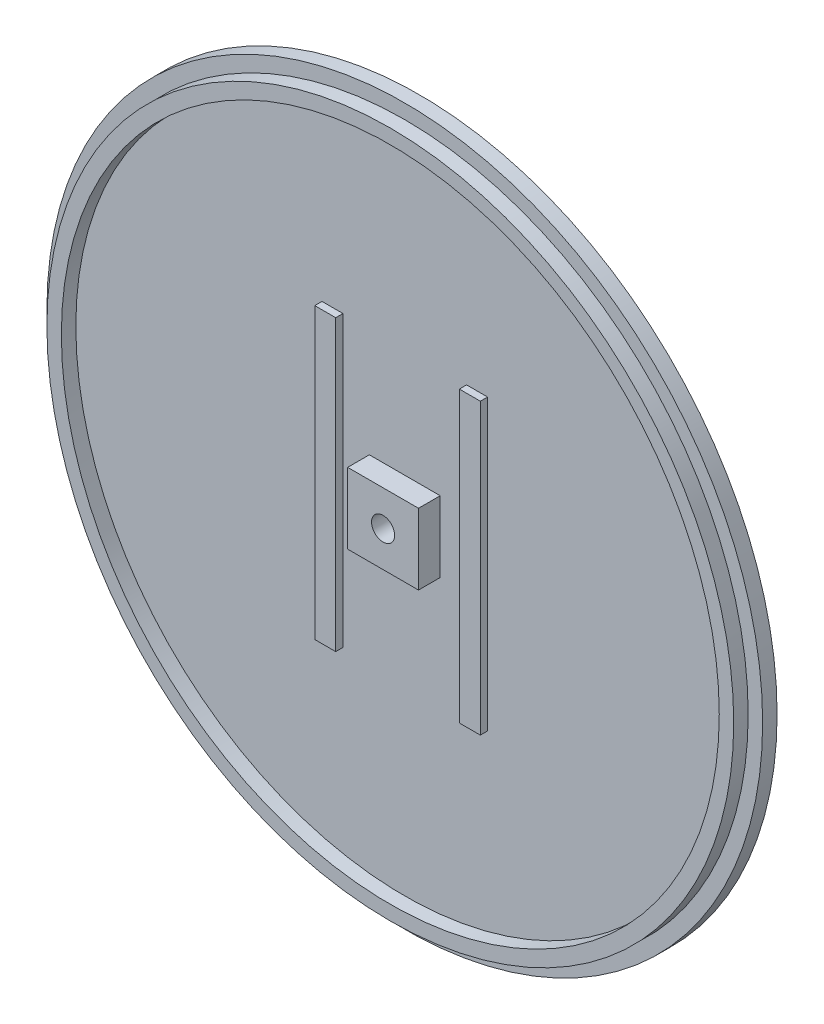
ISO-10303-21;
HEADER;
FILE_DESCRIPTION(('STEP AP214'),'2;1');
FILE_NAME('part.step','',(''),(''),'','','');
FILE_SCHEMA(('AUTOMOTIVE_DESIGN { 1 0 10303 214 1 1 1 1 }'));
ENDSEC;
DATA;
#1=APPLICATION_CONTEXT('core data for automotive mechanical design processes');
#2=APPLICATION_PROTOCOL_DEFINITION('international standard','automotive_design',2000,#1);
#3=PRODUCT_CONTEXT('',#1,'mechanical');
#4=PRODUCT('Part','Part','',(#3));
#5=PRODUCT_RELATED_PRODUCT_CATEGORY('part','',(#4));
#6=PRODUCT_DEFINITION_FORMATION('','',#4);
#7=PRODUCT_DEFINITION_CONTEXT('part definition',#1,'design');
#8=PRODUCT_DEFINITION('design','',#6,#7);
#9=PRODUCT_DEFINITION_SHAPE('','',#8);
#10=(LENGTH_UNIT() NAMED_UNIT(*) SI_UNIT(.MILLI.,.METRE.));
#11=(NAMED_UNIT(*) PLANE_ANGLE_UNIT() SI_UNIT($,.RADIAN.));
#12=(NAMED_UNIT(*) SI_UNIT($,.STERADIAN.) SOLID_ANGLE_UNIT());
#13=UNCERTAINTY_MEASURE_WITH_UNIT(LENGTH_MEASURE(1.E-05),#10,'distance_accuracy_value','');
#14=(GEOMETRIC_REPRESENTATION_CONTEXT(3) GLOBAL_UNCERTAINTY_ASSIGNED_CONTEXT((#13)) GLOBAL_UNIT_ASSIGNED_CONTEXT((#10,
#11,#12)) REPRESENTATION_CONTEXT('',''));
#15=CARTESIAN_POINT('',(0.,0.,0.));
#16=DIRECTION('',(0.,0.,1.));
#17=DIRECTION('',(1.,0.,0.));
#18=AXIS2_PLACEMENT_3D('',#15,#16,#17);
#19=CARTESIAN_POINT('',(0.,0.,2.));
#20=DIRECTION('',(0.,0.,1.));
#21=DIRECTION('',(1.,0.,0.));
#22=AXIS2_PLACEMENT_3D('',#19,#20,#21);
#23=PLANE('',#22);
#24=DIRECTION('',(1.,0.,0.));
#25=VECTOR('',#24,1.);
#26=CARTESIAN_POINT('',(-4.9,-4.9,2.));
#27=LINE('',#26,#25);
#28=CARTESIAN_POINT('',(-4.9,-4.9,2.));
#29=VERTEX_POINT('',#28);
#30=CARTESIAN_POINT('',(4.9,-4.9,2.));
#31=VERTEX_POINT('',#30);
#32=EDGE_CURVE('E334',#29,#31,#27,.T.);
#33=ORIENTED_EDGE('',*,*,#32,.F.);
#34=DIRECTION('',(0.,-1.,0.));
#35=VECTOR('',#34,1.);
#36=CARTESIAN_POINT('',(-4.9,4.9,2.));
#37=LINE('',#36,#35);
#38=CARTESIAN_POINT('',(-4.9,4.9,2.));
#39=VERTEX_POINT('',#38);
#40=EDGE_CURVE('E146',#39,#29,#37,.T.);
#41=ORIENTED_EDGE('',*,*,#40,.F.);
#42=DIRECTION('',(-1.,0.,0.));
#43=VECTOR('',#42,1.);
#44=CARTESIAN_POINT('',(-4.9,4.9,2.));
#45=LINE('',#44,#43);
#46=CARTESIAN_POINT('',(4.9,4.9,2.));
#47=VERTEX_POINT('',#46);
#48=EDGE_CURVE('E142',#47,#39,#45,.T.);
#49=ORIENTED_EDGE('',*,*,#48,.F.);
#50=DIRECTION('',(0.,1.,0.));
#51=VECTOR('',#50,1.);
#52=CARTESIAN_POINT('',(4.9,4.9,2.));
#53=LINE('',#52,#51);
#54=EDGE_CURVE('E336',#31,#47,#53,.T.);
#55=ORIENTED_EDGE('',*,*,#54,.F.);
#56=EDGE_LOOP('',(#33,#41,#49,#55));
#57=FACE_BOUND('',#56,.T.);
#58=DIRECTION('',(1.,0.,0.));
#59=VECTOR('',#58,1.);
#60=CARTESIAN_POINT('',(8.54909975535215,-20.,2.));
#61=LINE('',#60,#59);
#62=CARTESIAN_POINT('',(8.54909975535215,-20.,2.));
#63=VERTEX_POINT('',#62);
#64=CARTESIAN_POINT('',(11.4509002446479,-20.,2.));
#65=VERTEX_POINT('',#64);
#66=EDGE_CURVE('E151',#63,#65,#61,.T.);
#67=ORIENTED_EDGE('',*,*,#66,.F.);
#68=DIRECTION('',(0.,-1.,0.));
#69=VECTOR('',#68,1.);
#70=CARTESIAN_POINT('',(8.54909975535215,20.,2.));
#71=LINE('',#70,#69);
#72=CARTESIAN_POINT('',(8.54909975535215,20.,2.));
#73=VERTEX_POINT('',#72);
#74=EDGE_CURVE('E148',#73,#63,#71,.T.);
#75=ORIENTED_EDGE('',*,*,#74,.F.);
#76=DIRECTION('',(-1.,0.,0.));
#77=VECTOR('',#76,1.);
#78=CARTESIAN_POINT('',(8.54909975535215,20.,2.));
#79=LINE('',#78,#77);
#80=CARTESIAN_POINT('',(11.4509002446478,20.,2.));
#81=VERTEX_POINT('',#80);
#82=EDGE_CURVE('E160',#81,#73,#79,.T.);
#83=ORIENTED_EDGE('',*,*,#82,.F.);
#84=DIRECTION('',(0.,1.,0.));
#85=VECTOR('',#84,1.);
#86=CARTESIAN_POINT('',(11.4509002446478,20.,2.));
#87=LINE('',#86,#85);
#88=EDGE_CURVE('E168',#65,#81,#87,.T.);
#89=ORIENTED_EDGE('',*,*,#88,.F.);
#90=EDGE_LOOP('',(#67,#75,#83,#89));
#91=FACE_BOUND('',#90,.T.);
#92=DIRECTION('',(1.,0.,0.));
#93=VECTOR('',#92,1.);
#94=CARTESIAN_POINT('',(-11.45,-20.,2.));
#95=LINE('',#94,#93);
#96=CARTESIAN_POINT('',(-11.45,-20.,2.));
#97=VERTEX_POINT('',#96);
#98=CARTESIAN_POINT('',(-8.55,-20.,2.));
#99=VERTEX_POINT('',#98);
#100=EDGE_CURVE('E193',#97,#99,#95,.T.);
#101=ORIENTED_EDGE('',*,*,#100,.F.);
#102=DIRECTION('',(0.,-1.,0.));
#103=VECTOR('',#102,1.);
#104=CARTESIAN_POINT('',(-11.45,20.,2.));
#105=LINE('',#104,#103);
#106=CARTESIAN_POINT('',(-11.45,20.,2.));
#107=VERTEX_POINT('',#106);
#108=EDGE_CURVE('E179',#107,#97,#105,.T.);
#109=ORIENTED_EDGE('',*,*,#108,.F.);
#110=DIRECTION('',(-1.,0.,0.));
#111=VECTOR('',#110,1.);
#112=CARTESIAN_POINT('',(-11.45,20.,2.));
#113=LINE('',#112,#111);
#114=CARTESIAN_POINT('',(-8.55,20.,2.));
#115=VERTEX_POINT('',#114);
#116=EDGE_CURVE('E184',#115,#107,#113,.T.);
#117=ORIENTED_EDGE('',*,*,#116,.F.);
#118=DIRECTION('',(0.,1.,0.));
#119=VECTOR('',#118,1.);
#120=CARTESIAN_POINT('',(-8.55,20.,2.));
#121=LINE('',#120,#119);
#122=EDGE_CURVE('E195',#99,#115,#121,.T.);
#123=ORIENTED_EDGE('',*,*,#122,.F.);
#124=EDGE_LOOP('',(#101,#109,#117,#123));
#125=FACE_BOUND('',#124,.T.);
#126=CARTESIAN_POINT('',(0.,0.,2.));
#127=DIRECTION('',(0.,0.,1.));
#128=DIRECTION('',(1.,0.,0.));
#129=AXIS2_PLACEMENT_3D('',#126,#127,#128);
#130=CIRCLE('',#129,45.5);
#131=CARTESIAN_POINT('',(45.5,0.,2.));
#132=VERTEX_POINT('',#131);
#133=EDGE_CURVE('E11',#132,#132,#130,.F.);
#134=ORIENTED_EDGE('',*,*,#133,.F.);
#135=EDGE_LOOP('',(#134));
#136=FACE_BOUND('',#135,.T.);
#137=ADVANCED_FACE('F33',(#57,#91,#125,#136),#23,.T.);
#138=CARTESIAN_POINT('',(0.,0.,2.));
#139=DIRECTION('',(0.,0.,1.));
#140=DIRECTION('',(1.,0.,0.));
#141=AXIS2_PLACEMENT_3D('',#138,#139,#140);
#142=CIRCLE('',#141,47.5);
#143=CARTESIAN_POINT('',(47.5,0.,2.));
#144=VERTEX_POINT('',#143);
#145=EDGE_CURVE('E313',#144,#144,#142,.T.);
#146=ORIENTED_EDGE('',*,*,#145,.F.);
#147=EDGE_LOOP('',(#146));
#148=FACE_BOUND('',#147,.T.);
#149=CARTESIAN_POINT('',(0.,0.,2.));
#150=DIRECTION('',(0.,0.,1.));
#151=DIRECTION('',(1.,0.,0.));
#152=AXIS2_PLACEMENT_3D('',#149,#150,#151);
#153=CIRCLE('',#152,49.5);
#154=CARTESIAN_POINT('',(49.5,0.,2.));
#155=VERTEX_POINT('',#154);
#156=EDGE_CURVE('E41',#155,#155,#153,.T.);
#157=ORIENTED_EDGE('',*,*,#156,.T.);
#158=EDGE_LOOP('',(#157));
#159=FACE_BOUND('',#158,.T.);
#160=ADVANCED_FACE('F225',(#148,#159),#23,.T.);
#161=CARTESIAN_POINT('',(0.,0.,2.));
#162=DIRECTION('',(0.,0.,-1.));
#163=DIRECTION('',(-1.,0.,0.));
#164=AXIS2_PLACEMENT_3D('',#161,#162,#163);
#165=CYLINDRICAL_SURFACE('',#164,49.5);
#166=ORIENTED_EDGE('',*,*,#156,.F.);
#167=EDGE_LOOP('',(#166));
#168=FACE_BOUND('',#167,.T.);
#169=CARTESIAN_POINT('',(0.,0.,0.));
#170=DIRECTION('',(0.,0.,1.));
#171=DIRECTION('',(1.,0.,0.));
#172=AXIS2_PLACEMENT_3D('',#169,#170,#171);
#173=CIRCLE('',#172,49.5);
#174=CARTESIAN_POINT('',(49.5,0.,0.));
#175=VERTEX_POINT('',#174);
#176=EDGE_CURVE('E208',#175,#175,#173,.T.);
#177=ORIENTED_EDGE('',*,*,#176,.T.);
#178=EDGE_LOOP('',(#177));
#179=FACE_BOUND('',#178,.T.);
#180=ADVANCED_FACE('F35',(#168,#179),#165,.T.);
#181=CARTESIAN_POINT('',(0.,0.,0.));
#182=DIRECTION('',(0.,0.,1.));
#183=DIRECTION('',(1.,0.,0.));
#184=AXIS2_PLACEMENT_3D('',#181,#182,#183);
#185=PLANE('',#184);
#186=CARTESIAN_POINT('',(0.,0.,0.));
#187=DIRECTION('',(0.,0.,-1.));
#188=DIRECTION('',(-1.,0.,0.));
#189=AXIS2_PLACEMENT_3D('',#186,#187,#188);
#190=CIRCLE('',#189,3.);
#191=CARTESIAN_POINT('',(-3.,0.,0.));
#192=VERTEX_POINT('',#191);
#193=EDGE_CURVE('E320',#192,#192,#190,.T.);
#194=ORIENTED_EDGE('',*,*,#193,.F.);
#195=EDGE_LOOP('',(#194));
#196=FACE_BOUND('',#195,.T.);
#197=ORIENTED_EDGE('',*,*,#176,.F.);
#198=EDGE_LOOP('',(#197));
#199=FACE_BOUND('',#198,.T.);
#200=ADVANCED_FACE('F214',(#196,#199),#185,.F.);
#201=CARTESIAN_POINT('',(-11.45,20.,3.));
#202=DIRECTION('',(1.,0.,0.));
#203=DIRECTION('',(0.,1.,0.));
#204=AXIS2_PLACEMENT_3D('',#201,#202,#203);
#205=PLANE('',#204);
#206=ORIENTED_EDGE('',*,*,#108,.T.);
#207=DIRECTION('',(0.,0.,-1.));
#208=VECTOR('',#207,1.);
#209=CARTESIAN_POINT('',(-11.45,-20.,3.));
#210=LINE('',#209,#208);
#211=CARTESIAN_POINT('',(-11.45,-20.,3.));
#212=VERTEX_POINT('',#211);
#213=EDGE_CURVE('E206',#212,#97,#210,.T.);
#214=ORIENTED_EDGE('',*,*,#213,.F.);
#215=DIRECTION('',(0.,-1.,0.));
#216=VECTOR('',#215,1.);
#217=CARTESIAN_POINT('',(-11.45,20.,3.));
#218=LINE('',#217,#216);
#219=CARTESIAN_POINT('',(-11.45,20.,3.));
#220=VERTEX_POINT('',#219);
#221=EDGE_CURVE('E180',#220,#212,#218,.T.);
#222=ORIENTED_EDGE('',*,*,#221,.F.);
#223=DIRECTION('',(0.,0.,-1.));
#224=VECTOR('',#223,1.);
#225=CARTESIAN_POINT('',(-11.45,20.,3.));
#226=LINE('',#225,#224);
#227=EDGE_CURVE('E190',#220,#107,#226,.T.);
#228=ORIENTED_EDGE('',*,*,#227,.T.);
#229=EDGE_LOOP('',(#206,#214,#222,#228));
#230=FACE_BOUND('',#229,.T.);
#231=ADVANCED_FACE('F216',(#230),#205,.F.);
#232=CARTESIAN_POINT('',(-11.45,-20.,3.));
#233=DIRECTION('',(0.,1.,0.));
#234=DIRECTION('',(0.,0.,1.));
#235=AXIS2_PLACEMENT_3D('',#232,#233,#234);
#236=PLANE('',#235);
#237=ORIENTED_EDGE('',*,*,#100,.T.);
#238=DIRECTION('',(0.,0.,-1.));
#239=VECTOR('',#238,1.);
#240=CARTESIAN_POINT('',(-8.55,-20.,3.));
#241=LINE('',#240,#239);
#242=CARTESIAN_POINT('',(-8.55,-20.,3.));
#243=VERTEX_POINT('',#242);
#244=EDGE_CURVE('E203',#243,#99,#241,.T.);
#245=ORIENTED_EDGE('',*,*,#244,.F.);
#246=DIRECTION('',(1.,0.,0.));
#247=VECTOR('',#246,1.);
#248=CARTESIAN_POINT('',(-11.45,-20.,3.));
#249=LINE('',#248,#247);
#250=EDGE_CURVE('E183',#212,#243,#249,.T.);
#251=ORIENTED_EDGE('',*,*,#250,.F.);
#252=ORIENTED_EDGE('',*,*,#213,.T.);
#253=EDGE_LOOP('',(#237,#245,#251,#252));
#254=FACE_BOUND('',#253,.T.);
#255=ADVANCED_FACE('F222',(#254),#236,.F.);
#256=CARTESIAN_POINT('',(-8.55,20.,3.));
#257=DIRECTION('',(-1.,0.,0.));
#258=DIRECTION('',(0.,-1.,0.));
#259=AXIS2_PLACEMENT_3D('',#256,#257,#258);
#260=PLANE('',#259);
#261=ORIENTED_EDGE('',*,*,#122,.T.);
#262=DIRECTION('',(0.,0.,-1.));
#263=VECTOR('',#262,1.);
#264=CARTESIAN_POINT('',(-8.55,20.,3.));
#265=LINE('',#264,#263);
#266=CARTESIAN_POINT('',(-8.55,20.,3.));
#267=VERTEX_POINT('',#266);
#268=EDGE_CURVE('E201',#267,#115,#265,.T.);
#269=ORIENTED_EDGE('',*,*,#268,.F.);
#270=DIRECTION('',(0.,1.,0.));
#271=VECTOR('',#270,1.);
#272=CARTESIAN_POINT('',(-8.55,20.,3.));
#273=LINE('',#272,#271);
#274=EDGE_CURVE('E186',#243,#267,#273,.T.);
#275=ORIENTED_EDGE('',*,*,#274,.F.);
#276=ORIENTED_EDGE('',*,*,#244,.T.);
#277=EDGE_LOOP('',(#261,#269,#275,#276));
#278=FACE_BOUND('',#277,.T.);
#279=ADVANCED_FACE('F239',(#278),#260,.F.);
#280=CARTESIAN_POINT('',(-11.45,20.,3.));
#281=DIRECTION('',(0.,-1.,0.));
#282=DIRECTION('',(0.,0.,-1.));
#283=AXIS2_PLACEMENT_3D('',#280,#281,#282);
#284=PLANE('',#283);
#285=ORIENTED_EDGE('',*,*,#116,.T.);
#286=ORIENTED_EDGE('',*,*,#227,.F.);
#287=DIRECTION('',(-1.,0.,0.));
#288=VECTOR('',#287,1.);
#289=CARTESIAN_POINT('',(-11.45,20.,3.));
#290=LINE('',#289,#288);
#291=EDGE_CURVE('E188',#267,#220,#290,.T.);
#292=ORIENTED_EDGE('',*,*,#291,.F.);
#293=ORIENTED_EDGE('',*,*,#268,.T.);
#294=EDGE_LOOP('',(#285,#286,#292,#293));
#295=FACE_BOUND('',#294,.T.);
#296=ADVANCED_FACE('F243',(#295),#284,.F.);
#297=CARTESIAN_POINT('',(0.,0.,3.));
#298=DIRECTION('',(0.,0.,1.));
#299=DIRECTION('',(1.,0.,0.));
#300=AXIS2_PLACEMENT_3D('',#297,#298,#299);
#301=PLANE('',#300);
#302=ORIENTED_EDGE('',*,*,#221,.T.);
#303=ORIENTED_EDGE('',*,*,#250,.T.);
#304=ORIENTED_EDGE('',*,*,#274,.T.);
#305=ORIENTED_EDGE('',*,*,#291,.T.);
#306=EDGE_LOOP('',(#302,#303,#304,#305));
#307=FACE_BOUND('',#306,.T.);
#308=ADVANCED_FACE('F247',(#307),#301,.T.);
#309=CARTESIAN_POINT('',(8.54909975535215,20.,3.));
#310=DIRECTION('',(1.,0.,0.));
#311=DIRECTION('',(0.,1.,0.));
#312=AXIS2_PLACEMENT_3D('',#309,#310,#311);
#313=PLANE('',#312);
#314=ORIENTED_EDGE('',*,*,#74,.T.);
#315=DIRECTION('',(0.,0.,-1.));
#316=VECTOR('',#315,1.);
#317=CARTESIAN_POINT('',(8.54909975535215,-20.,3.));
#318=LINE('',#317,#316);
#319=CARTESIAN_POINT('',(8.54909975535215,-20.,3.));
#320=VERTEX_POINT('',#319);
#321=EDGE_CURVE('E177',#320,#63,#318,.T.);
#322=ORIENTED_EDGE('',*,*,#321,.F.);
#323=DIRECTION('',(0.,-1.,0.));
#324=VECTOR('',#323,1.);
#325=CARTESIAN_POINT('',(8.54909975535215,20.,3.));
#326=LINE('',#325,#324);
#327=CARTESIAN_POINT('',(8.54909975535215,20.,3.));
#328=VERTEX_POINT('',#327);
#329=EDGE_CURVE('E156',#328,#320,#326,.T.);
#330=ORIENTED_EDGE('',*,*,#329,.F.);
#331=DIRECTION('',(0.,0.,-1.));
#332=VECTOR('',#331,1.);
#333=CARTESIAN_POINT('',(8.54909975535215,20.,3.));
#334=LINE('',#333,#332);
#335=EDGE_CURVE('E165',#328,#73,#334,.T.);
#336=ORIENTED_EDGE('',*,*,#335,.T.);
#337=EDGE_LOOP('',(#314,#322,#330,#336));
#338=FACE_BOUND('',#337,.T.);
#339=ADVANCED_FACE('F251',(#338),#313,.F.);
#340=CARTESIAN_POINT('',(8.54909975535215,-20.,3.));
#341=DIRECTION('',(0.,1.,0.));
#342=DIRECTION('',(0.,0.,1.));
#343=AXIS2_PLACEMENT_3D('',#340,#341,#342);
#344=PLANE('',#343);
#345=ORIENTED_EDGE('',*,*,#66,.T.);
#346=DIRECTION('',(0.,0.,-1.));
#347=VECTOR('',#346,1.);
#348=CARTESIAN_POINT('',(11.4509002446479,-20.,3.));
#349=LINE('',#348,#347);
#350=CARTESIAN_POINT('',(11.4509002446479,-20.,3.));
#351=VERTEX_POINT('',#350);
#352=EDGE_CURVE('E174',#351,#65,#349,.T.);
#353=ORIENTED_EDGE('',*,*,#352,.F.);
#354=DIRECTION('',(1.,0.,0.));
#355=VECTOR('',#354,1.);
#356=CARTESIAN_POINT('',(8.54909975535215,-20.,3.));
#357=LINE('',#356,#355);
#358=EDGE_CURVE('E159',#320,#351,#357,.T.);
#359=ORIENTED_EDGE('',*,*,#358,.F.);
#360=ORIENTED_EDGE('',*,*,#321,.T.);
#361=EDGE_LOOP('',(#345,#353,#359,#360));
#362=FACE_BOUND('',#361,.T.);
#363=ADVANCED_FACE('F255',(#362),#344,.F.);
#364=CARTESIAN_POINT('',(11.4509002446478,20.,3.));
#365=DIRECTION('',(-1.,0.,0.));
#366=DIRECTION('',(0.,-1.,0.));
#367=AXIS2_PLACEMENT_3D('',#364,#365,#366);
#368=PLANE('',#367);
#369=ORIENTED_EDGE('',*,*,#88,.T.);
#370=DIRECTION('',(0.,0.,-1.));
#371=VECTOR('',#370,1.);
#372=CARTESIAN_POINT('',(11.4509002446478,20.,3.));
#373=LINE('',#372,#371);
#374=CARTESIAN_POINT('',(11.4509002446478,20.,3.));
#375=VERTEX_POINT('',#374);
#376=EDGE_CURVE('E56',#375,#81,#373,.T.);
#377=ORIENTED_EDGE('',*,*,#376,.F.);
#378=DIRECTION('',(0.,1.,0.));
#379=VECTOR('',#378,1.);
#380=CARTESIAN_POINT('',(11.4509002446478,20.,3.));
#381=LINE('',#380,#379);
#382=EDGE_CURVE('E162',#351,#375,#381,.T.);
#383=ORIENTED_EDGE('',*,*,#382,.F.);
#384=ORIENTED_EDGE('',*,*,#352,.T.);
#385=EDGE_LOOP('',(#369,#377,#383,#384));
#386=FACE_BOUND('',#385,.T.);
#387=ADVANCED_FACE('F259',(#386),#368,.F.);
#388=CARTESIAN_POINT('',(8.54909975535215,20.,3.));
#389=DIRECTION('',(0.,-1.,0.));
#390=DIRECTION('',(0.,0.,-1.));
#391=AXIS2_PLACEMENT_3D('',#388,#389,#390);
#392=PLANE('',#391);
#393=ORIENTED_EDGE('',*,*,#82,.T.);
#394=ORIENTED_EDGE('',*,*,#335,.F.);
#395=DIRECTION('',(-1.,0.,0.));
#396=VECTOR('',#395,1.);
#397=CARTESIAN_POINT('',(8.54909975535215,20.,3.));
#398=LINE('',#397,#396);
#399=EDGE_CURVE('E164',#375,#328,#398,.T.);
#400=ORIENTED_EDGE('',*,*,#399,.F.);
#401=ORIENTED_EDGE('',*,*,#376,.T.);
#402=EDGE_LOOP('',(#393,#394,#400,#401));
#403=FACE_BOUND('',#402,.T.);
#404=ADVANCED_FACE('F263',(#403),#392,.F.);
#405=CARTESIAN_POINT('',(0.,0.,3.));
#406=DIRECTION('',(0.,0.,1.));
#407=DIRECTION('',(1.,0.,0.));
#408=AXIS2_PLACEMENT_3D('',#405,#406,#407);
#409=PLANE('',#408);
#410=ORIENTED_EDGE('',*,*,#329,.T.);
#411=ORIENTED_EDGE('',*,*,#358,.T.);
#412=ORIENTED_EDGE('',*,*,#382,.T.);
#413=ORIENTED_EDGE('',*,*,#399,.T.);
#414=EDGE_LOOP('',(#410,#411,#412,#413));
#415=FACE_BOUND('',#414,.T.);
#416=ADVANCED_FACE('F267',(#415),#409,.T.);
#417=CARTESIAN_POINT('',(-4.9,4.9,5.));
#418=DIRECTION('',(1.,0.,0.));
#419=DIRECTION('',(0.,0.,-1.));
#420=AXIS2_PLACEMENT_3D('',#417,#418,#419);
#421=PLANE('',#420);
#422=ORIENTED_EDGE('',*,*,#40,.T.);
#423=DIRECTION('',(0.,0.,-1.));
#424=VECTOR('',#423,1.);
#425=CARTESIAN_POINT('',(-4.9,-4.9,5.));
#426=LINE('',#425,#424);
#427=CARTESIAN_POINT('',(-4.9,-4.9,5.));
#428=VERTEX_POINT('',#427);
#429=EDGE_CURVE('E127',#428,#29,#426,.T.);
#430=ORIENTED_EDGE('',*,*,#429,.F.);
#431=DIRECTION('',(0.,-1.,0.));
#432=VECTOR('',#431,1.);
#433=CARTESIAN_POINT('',(-4.9,4.9,5.));
#434=LINE('',#433,#432);
#435=CARTESIAN_POINT('',(-4.9,4.9,5.));
#436=VERTEX_POINT('',#435);
#437=EDGE_CURVE('E134',#436,#428,#434,.T.);
#438=ORIENTED_EDGE('',*,*,#437,.F.);
#439=DIRECTION('',(0.,0.,-1.));
#440=VECTOR('',#439,1.);
#441=CARTESIAN_POINT('',(-4.9,4.9,5.));
#442=LINE('',#441,#440);
#443=EDGE_CURVE('E332',#436,#39,#442,.T.);
#444=ORIENTED_EDGE('',*,*,#443,.T.);
#445=EDGE_LOOP('',(#422,#430,#438,#444));
#446=FACE_BOUND('',#445,.T.);
#447=ADVANCED_FACE('F144',(#446),#421,.F.);
#448=CARTESIAN_POINT('',(-4.9,-4.9,5.));
#449=DIRECTION('',(0.,1.,0.));
#450=DIRECTION('',(0.,0.,1.));
#451=AXIS2_PLACEMENT_3D('',#448,#449,#450);
#452=PLANE('',#451);
#453=ORIENTED_EDGE('',*,*,#32,.T.);
#454=DIRECTION('',(0.,0.,-1.));
#455=VECTOR('',#454,1.);
#456=CARTESIAN_POINT('',(4.9,-4.9,5.));
#457=LINE('',#456,#455);
#458=CARTESIAN_POINT('',(4.9,-4.9,5.));
#459=VERTEX_POINT('',#458);
#460=EDGE_CURVE('E130',#459,#31,#457,.T.);
#461=ORIENTED_EDGE('',*,*,#460,.F.);
#462=DIRECTION('',(1.,0.,0.));
#463=VECTOR('',#462,1.);
#464=CARTESIAN_POINT('',(-4.9,-4.9,5.));
#465=LINE('',#464,#463);
#466=EDGE_CURVE('E123',#428,#459,#465,.T.);
#467=ORIENTED_EDGE('',*,*,#466,.F.);
#468=ORIENTED_EDGE('',*,*,#429,.T.);
#469=EDGE_LOOP('',(#453,#461,#467,#468));
#470=FACE_BOUND('',#469,.T.);
#471=ADVANCED_FACE('F125',(#470),#452,.F.);
#472=CARTESIAN_POINT('',(4.9,4.9,5.));
#473=DIRECTION('',(-1.,0.,0.));
#474=DIRECTION('',(0.,-1.,0.));
#475=AXIS2_PLACEMENT_3D('',#472,#473,#474);
#476=PLANE('',#475);
#477=ORIENTED_EDGE('',*,*,#54,.T.);
#478=DIRECTION('',(0.,0.,-1.));
#479=VECTOR('',#478,1.);
#480=CARTESIAN_POINT('',(4.9,4.9,5.));
#481=LINE('',#480,#479);
#482=CARTESIAN_POINT('',(4.9,4.9,5.));
#483=VERTEX_POINT('',#482);
#484=EDGE_CURVE('E48',#483,#47,#481,.T.);
#485=ORIENTED_EDGE('',*,*,#484,.F.);
#486=DIRECTION('',(0.,1.,0.));
#487=VECTOR('',#486,1.);
#488=CARTESIAN_POINT('',(4.9,4.9,5.));
#489=LINE('',#488,#487);
#490=EDGE_CURVE('E133',#459,#483,#489,.T.);
#491=ORIENTED_EDGE('',*,*,#490,.F.);
#492=ORIENTED_EDGE('',*,*,#460,.T.);
#493=EDGE_LOOP('',(#477,#485,#491,#492));
#494=FACE_BOUND('',#493,.T.);
#495=ADVANCED_FACE('F275',(#494),#476,.F.);
#496=CARTESIAN_POINT('',(-4.9,4.9,5.));
#497=DIRECTION('',(0.,-1.,0.));
#498=DIRECTION('',(0.,0.,-1.));
#499=AXIS2_PLACEMENT_3D('',#496,#497,#498);
#500=PLANE('',#499);
#501=ORIENTED_EDGE('',*,*,#48,.T.);
#502=ORIENTED_EDGE('',*,*,#443,.F.);
#503=DIRECTION('',(-1.,0.,0.));
#504=VECTOR('',#503,1.);
#505=CARTESIAN_POINT('',(-4.9,4.9,5.));
#506=LINE('',#505,#504);
#507=EDGE_CURVE('E138',#483,#436,#506,.T.);
#508=ORIENTED_EDGE('',*,*,#507,.F.);
#509=ORIENTED_EDGE('',*,*,#484,.T.);
#510=EDGE_LOOP('',(#501,#502,#508,#509));
#511=FACE_BOUND('',#510,.T.);
#512=ADVANCED_FACE('F278',(#511),#500,.F.);
#513=CARTESIAN_POINT('',(0.,0.,5.));
#514=DIRECTION('',(0.,0.,1.));
#515=DIRECTION('',(1.,0.,0.));
#516=AXIS2_PLACEMENT_3D('',#513,#514,#515);
#517=PLANE('',#516);
#518=CARTESIAN_POINT('',(0.,0.,5.));
#519=DIRECTION('',(0.,0.,-1.));
#520=DIRECTION('',(-1.,0.,0.));
#521=AXIS2_PLACEMENT_3D('',#518,#519,#520);
#522=CIRCLE('',#521,1.6);
#523=CARTESIAN_POINT('',(-1.6,0.,5.));
#524=VERTEX_POINT('',#523);
#525=EDGE_CURVE('E327',#524,#524,#522,.T.);
#526=ORIENTED_EDGE('',*,*,#525,.T.);
#527=EDGE_LOOP('',(#526));
#528=FACE_BOUND('',#527,.T.);
#529=ORIENTED_EDGE('',*,*,#437,.T.);
#530=ORIENTED_EDGE('',*,*,#466,.T.);
#531=ORIENTED_EDGE('',*,*,#490,.T.);
#532=ORIENTED_EDGE('',*,*,#507,.T.);
#533=EDGE_LOOP('',(#529,#530,#531,#532));
#534=FACE_BOUND('',#533,.T.);
#535=ADVANCED_FACE('F137',(#528,#534),#517,.T.);
#536=CARTESIAN_POINT('',(0.,0.,0.));
#537=DIRECTION('',(0.,0.,-1.));
#538=DIRECTION('',(-1.,0.,0.));
#539=AXIS2_PLACEMENT_3D('',#536,#537,#538);
#540=CYLINDRICAL_SURFACE('',#539,1.6);
#541=ORIENTED_EDGE('',*,*,#525,.F.);
#542=EDGE_LOOP('',(#541));
#543=FACE_BOUND('',#542,.T.);
#544=CARTESIAN_POINT('',(0.,0.,1.4));
#545=DIRECTION('',(0.,0.,-1.));
#546=DIRECTION('',(-1.,0.,0.));
#547=AXIS2_PLACEMENT_3D('',#544,#545,#546);
#548=CIRCLE('',#547,1.6);
#549=CARTESIAN_POINT('',(-1.6,0.,1.4));
#550=VERTEX_POINT('',#549);
#551=EDGE_CURVE('E324',#550,#550,#548,.T.);
#552=ORIENTED_EDGE('',*,*,#551,.T.);
#553=EDGE_LOOP('',(#552));
#554=FACE_BOUND('',#553,.T.);
#555=ADVANCED_FACE('F284',(#543,#554),#540,.F.);
#556=CARTESIAN_POINT('',(0.,0.,0.));
#557=DIRECTION('',(0.,0.,-1.));
#558=DIRECTION('',(-1.,0.,0.));
#559=AXIS2_PLACEMENT_3D('',#556,#557,#558);
#560=CONICAL_SURFACE('',#559,3.,0.785398163397449);
#561=ORIENTED_EDGE('',*,*,#551,.F.);
#562=EDGE_LOOP('',(#561));
#563=FACE_BOUND('',#562,.T.);
#564=ORIENTED_EDGE('',*,*,#193,.T.);
#565=EDGE_LOOP('',(#564));
#566=FACE_BOUND('',#565,.T.);
#567=ADVANCED_FACE('F288',(#563,#566),#560,.F.);
#568=CARTESIAN_POINT('',(0.,0.,4.));
#569=DIRECTION('',(0.,0.,1.));
#570=DIRECTION('',(1.,0.,0.));
#571=AXIS2_PLACEMENT_3D('',#568,#569,#570);
#572=PLANE('',#571);
#573=CARTESIAN_POINT('',(0.,0.,4.));
#574=DIRECTION('',(0.,0.,1.));
#575=DIRECTION('',(1.,0.,0.));
#576=AXIS2_PLACEMENT_3D('',#573,#574,#575);
#577=CIRCLE('',#576,47.5);
#578=CARTESIAN_POINT('',(47.5,0.,4.));
#579=VERTEX_POINT('',#578);
#580=EDGE_CURVE('E316',#579,#579,#577,.T.);
#581=ORIENTED_EDGE('',*,*,#580,.T.);
#582=EDGE_LOOP('',(#581));
#583=FACE_BOUND('',#582,.T.);
#584=CARTESIAN_POINT('',(0.,0.,4.));
#585=DIRECTION('',(0.,0.,1.));
#586=DIRECTION('',(1.,0.,0.));
#587=AXIS2_PLACEMENT_3D('',#584,#585,#586);
#588=CIRCLE('',#587,45.5);
#589=CARTESIAN_POINT('',(45.5,0.,4.));
#590=VERTEX_POINT('',#589);
#591=EDGE_CURVE('E309',#590,#590,#588,.T.);
#592=ORIENTED_EDGE('',*,*,#591,.F.);
#593=EDGE_LOOP('',(#592));
#594=FACE_BOUND('',#593,.T.);
#595=ADVANCED_FACE('F292',(#583,#594),#572,.T.);
#596=CARTESIAN_POINT('',(0.,0.,4.));
#597=DIRECTION('',(0.,0.,-1.));
#598=DIRECTION('',(-1.,0.,0.));
#599=AXIS2_PLACEMENT_3D('',#596,#597,#598);
#600=CYLINDRICAL_SURFACE('',#599,47.5);
#601=ORIENTED_EDGE('',*,*,#580,.F.);
#602=EDGE_LOOP('',(#601));
#603=FACE_BOUND('',#602,.T.);
#604=ORIENTED_EDGE('',*,*,#145,.T.);
#605=EDGE_LOOP('',(#604));
#606=FACE_BOUND('',#605,.T.);
#607=ADVANCED_FACE('F294',(#603,#606),#600,.T.);
#608=CARTESIAN_POINT('',(0.,0.,4.));
#609=DIRECTION('',(0.,0.,-1.));
#610=DIRECTION('',(-1.,0.,0.));
#611=AXIS2_PLACEMENT_3D('',#608,#609,#610);
#612=CYLINDRICAL_SURFACE('',#611,45.5);
#613=ORIENTED_EDGE('',*,*,#591,.T.);
#614=EDGE_LOOP('',(#613));
#615=FACE_BOUND('',#614,.T.);
#616=ORIENTED_EDGE('',*,*,#133,.T.);
#617=EDGE_LOOP('',(#616));
#618=FACE_BOUND('',#617,.T.);
#619=ADVANCED_FACE('F297',(#615,#618),#612,.F.);
#620=CLOSED_SHELL('',(#137,#160,#180,#200,#231,#255,#279,#296,#308,#339,#363,#387,#404,#416,
#447,#471,#495,#512,#535,#555,#567,#595,#607,#619));
#621=MANIFOLD_SOLID_BREP('B2',#620);
#622=ADVANCED_BREP_SHAPE_REPRESENTATION('',(#18,#621),#14);
#623=SHAPE_DEFINITION_REPRESENTATION(#9,#622);
ENDSEC;
END-ISO-10303-21;
